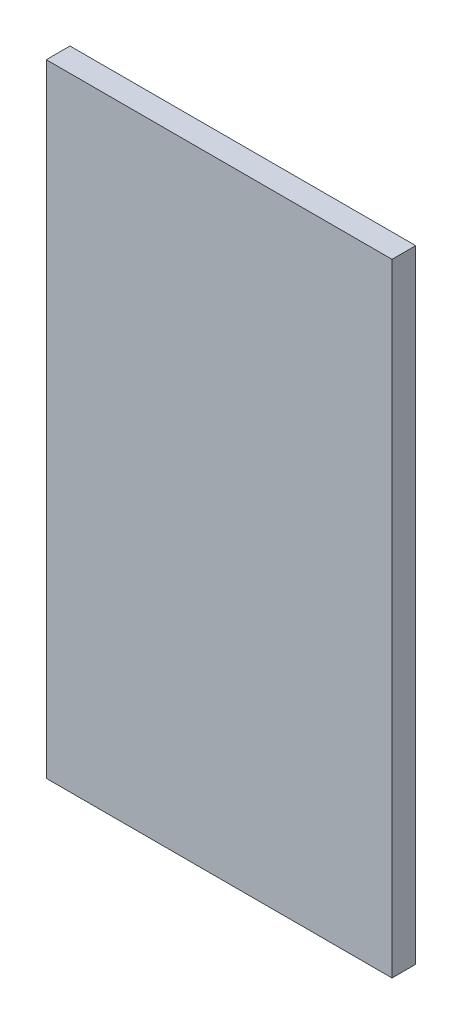
ISO-10303-21;
HEADER;
FILE_DESCRIPTION(('STEP AP214'),'2;1');
FILE_NAME('part.step','',(''),(''),'','','');
FILE_SCHEMA(('AUTOMOTIVE_DESIGN { 1 0 10303 214 1 1 1 1 }'));
ENDSEC;
DATA;
#1=APPLICATION_CONTEXT('core data for automotive mechanical design processes');
#2=APPLICATION_PROTOCOL_DEFINITION('international standard','automotive_design',2000,#1);
#3=PRODUCT_CONTEXT('',#1,'mechanical');
#4=PRODUCT('Part','Part','',(#3));
#5=PRODUCT_RELATED_PRODUCT_CATEGORY('part','',(#4));
#6=PRODUCT_DEFINITION_FORMATION('','',#4);
#7=PRODUCT_DEFINITION_CONTEXT('part definition',#1,'design');
#8=PRODUCT_DEFINITION('design','',#6,#7);
#9=PRODUCT_DEFINITION_SHAPE('','',#8);
#10=(LENGTH_UNIT() NAMED_UNIT(*) SI_UNIT(.MILLI.,.METRE.));
#11=(NAMED_UNIT(*) PLANE_ANGLE_UNIT() SI_UNIT($,.RADIAN.));
#12=(NAMED_UNIT(*) SI_UNIT($,.STERADIAN.) SOLID_ANGLE_UNIT());
#13=UNCERTAINTY_MEASURE_WITH_UNIT(LENGTH_MEASURE(1.E-05),#10,'distance_accuracy_value','');
#14=(GEOMETRIC_REPRESENTATION_CONTEXT(3) GLOBAL_UNCERTAINTY_ASSIGNED_CONTEXT((#13)) GLOBAL_UNIT_ASSIGNED_CONTEXT((#10,
#11,#12)) REPRESENTATION_CONTEXT('',''));
#15=CARTESIAN_POINT('',(0.,0.,0.));
#16=DIRECTION('',(0.,0.,1.));
#17=DIRECTION('',(1.,0.,0.));
#18=AXIS2_PLACEMENT_3D('',#15,#16,#17);
#19=CARTESIAN_POINT('',(4.20008,0.7,0.));
#20=DIRECTION('',(0.,0.,-1.));
#21=DIRECTION('',(-1.,0.,0.));
#22=AXIS2_PLACEMENT_3D('',#19,#20,#21);
#23=PLANE('',#22);
#24=DIRECTION('',(1.,0.,0.));
#25=VECTOR('',#24,1.);
#26=CARTESIAN_POINT('',(3.95008,1.15,0.));
#27=LINE('',#26,#25);
#28=CARTESIAN_POINT('',(3.95008,1.15,0.));
#29=VERTEX_POINT('',#28);
#30=CARTESIAN_POINT('',(4.45008,1.15,0.));
#31=VERTEX_POINT('',#30);
#32=EDGE_CURVE('E55',#29,#31,#27,.T.);
#33=ORIENTED_EDGE('',*,*,#32,.T.);
#34=DIRECTION('',(0.,1.,0.));
#35=VECTOR('',#34,1.);
#36=CARTESIAN_POINT('',(4.45008,1.15,0.));
#37=LINE('',#36,#35);
#38=CARTESIAN_POINT('',(4.45008,0.25,0.));
#39=VERTEX_POINT('',#38);
#40=EDGE_CURVE('E57',#31,#39,#37,.F.);
#41=ORIENTED_EDGE('',*,*,#40,.T.);
#42=DIRECTION('',(1.,0.,0.));
#43=VECTOR('',#42,1.);
#44=CARTESIAN_POINT('',(4.45008,0.25,0.));
#45=LINE('',#44,#43);
#46=CARTESIAN_POINT('',(3.95008,0.25,0.));
#47=VERTEX_POINT('',#46);
#48=EDGE_CURVE('E20',#39,#47,#45,.F.);
#49=ORIENTED_EDGE('',*,*,#48,.T.);
#50=DIRECTION('',(0.,1.,0.));
#51=VECTOR('',#50,1.);
#52=CARTESIAN_POINT('',(3.95008,0.25,0.));
#53=LINE('',#52,#51);
#54=EDGE_CURVE('E80',#47,#29,#53,.T.);
#55=ORIENTED_EDGE('',*,*,#54,.T.);
#56=EDGE_LOOP('',(#33,#41,#49,#55));
#57=FACE_BOUND('',#56,.T.);
#58=ADVANCED_FACE('F17',(#57),#23,.T.);
#59=CARTESIAN_POINT('',(4.45008,0.25,0.));
#60=DIRECTION('',(0.,1.,0.));
#61=DIRECTION('',(0.,0.,1.));
#62=AXIS2_PLACEMENT_3D('',#59,#60,#61);
#63=PLANE('',#62);
#64=DIRECTION('',(0.,0.,-1.));
#65=VECTOR('',#64,1.);
#66=CARTESIAN_POINT('',(3.95008,0.25,0.));
#67=LINE('',#66,#65);
#68=CARTESIAN_POINT('',(3.95008,0.25,0.03429));
#69=VERTEX_POINT('',#68);
#70=EDGE_CURVE('E68',#69,#47,#67,.T.);
#71=ORIENTED_EDGE('',*,*,#70,.T.);
#72=ORIENTED_EDGE('',*,*,#48,.F.);
#73=DIRECTION('',(0.,0.,1.));
#74=VECTOR('',#73,1.);
#75=CARTESIAN_POINT('',(4.45008,0.25,0.));
#76=LINE('',#75,#74);
#77=CARTESIAN_POINT('',(4.45008,0.25,0.03429));
#78=VERTEX_POINT('',#77);
#79=EDGE_CURVE('E63',#39,#78,#76,.T.);
#80=ORIENTED_EDGE('',*,*,#79,.T.);
#81=DIRECTION('',(1.,0.,0.));
#82=VECTOR('',#81,1.);
#83=CARTESIAN_POINT('',(4.20008,0.25,0.03429));
#84=LINE('',#83,#82);
#85=EDGE_CURVE('E83',#69,#78,#84,.T.);
#86=ORIENTED_EDGE('',*,*,#85,.F.);
#87=EDGE_LOOP('',(#71,#72,#80,#86));
#88=FACE_BOUND('',#87,.T.);
#89=ADVANCED_FACE('F65',(#88),#63,.F.);
#90=CARTESIAN_POINT('',(4.45008,1.15,0.));
#91=DIRECTION('',(-1.,0.,0.));
#92=DIRECTION('',(0.,0.,1.));
#93=AXIS2_PLACEMENT_3D('',#90,#91,#92);
#94=PLANE('',#93);
#95=ORIENTED_EDGE('',*,*,#79,.F.);
#96=ORIENTED_EDGE('',*,*,#40,.F.);
#97=DIRECTION('',(0.,0.,-1.));
#98=VECTOR('',#97,1.);
#99=CARTESIAN_POINT('',(4.45008,1.15,0.));
#100=LINE('',#99,#98);
#101=CARTESIAN_POINT('',(4.45008,1.15,0.03429));
#102=VERTEX_POINT('',#101);
#103=EDGE_CURVE('E75',#31,#102,#100,.F.);
#104=ORIENTED_EDGE('',*,*,#103,.T.);
#105=DIRECTION('',(0.,1.,0.));
#106=VECTOR('',#105,1.);
#107=CARTESIAN_POINT('',(4.45008,0.7,0.03429));
#108=LINE('',#107,#106);
#109=EDGE_CURVE('E72',#78,#102,#108,.T.);
#110=ORIENTED_EDGE('',*,*,#109,.F.);
#111=EDGE_LOOP('',(#95,#96,#104,#110));
#112=FACE_BOUND('',#111,.T.);
#113=ADVANCED_FACE('F70',(#112),#94,.F.);
#114=CARTESIAN_POINT('',(3.95008,1.15,0.));
#115=DIRECTION('',(0.,-1.,0.));
#116=DIRECTION('',(0.,0.,-1.));
#117=AXIS2_PLACEMENT_3D('',#114,#115,#116);
#118=PLANE('',#117);
#119=ORIENTED_EDGE('',*,*,#103,.F.);
#120=ORIENTED_EDGE('',*,*,#32,.F.);
#121=DIRECTION('',(0.,0.,-1.));
#122=VECTOR('',#121,1.);
#123=CARTESIAN_POINT('',(3.95008,1.15,0.));
#124=LINE('',#123,#122);
#125=CARTESIAN_POINT('',(3.95008,1.15,0.03429));
#126=VERTEX_POINT('',#125);
#127=EDGE_CURVE('E35',#29,#126,#124,.F.);
#128=ORIENTED_EDGE('',*,*,#127,.T.);
#129=DIRECTION('',(1.,0.,0.));
#130=VECTOR('',#129,1.);
#131=CARTESIAN_POINT('',(4.20008,1.15,0.03429));
#132=LINE('',#131,#130);
#133=EDGE_CURVE('E26',#102,#126,#132,.F.);
#134=ORIENTED_EDGE('',*,*,#133,.F.);
#135=EDGE_LOOP('',(#119,#120,#128,#134));
#136=FACE_BOUND('',#135,.T.);
#137=ADVANCED_FACE('F89',(#136),#118,.F.);
#138=CARTESIAN_POINT('',(3.95008,0.25,0.));
#139=DIRECTION('',(1.,0.,0.));
#140=DIRECTION('',(0.,0.,-1.));
#141=AXIS2_PLACEMENT_3D('',#138,#139,#140);
#142=PLANE('',#141);
#143=ORIENTED_EDGE('',*,*,#127,.F.);
#144=ORIENTED_EDGE('',*,*,#54,.F.);
#145=ORIENTED_EDGE('',*,*,#70,.F.);
#146=DIRECTION('',(0.,1.,0.));
#147=VECTOR('',#146,1.);
#148=CARTESIAN_POINT('',(3.95008,0.7,0.03429));
#149=LINE('',#148,#147);
#150=EDGE_CURVE('E11',#126,#69,#149,.F.);
#151=ORIENTED_EDGE('',*,*,#150,.F.);
#152=EDGE_LOOP('',(#143,#144,#145,#151));
#153=FACE_BOUND('',#152,.T.);
#154=ADVANCED_FACE('F91',(#153),#142,.F.);
#155=CARTESIAN_POINT('',(4.20008,0.7,0.03429));
#156=DIRECTION('',(0.,0.,1.));
#157=DIRECTION('',(1.,0.,0.));
#158=AXIS2_PLACEMENT_3D('',#155,#156,#157);
#159=PLANE('',#158);
#160=ORIENTED_EDGE('',*,*,#133,.T.);
#161=ORIENTED_EDGE('',*,*,#150,.T.);
#162=ORIENTED_EDGE('',*,*,#85,.T.);
#163=ORIENTED_EDGE('',*,*,#109,.T.);
#164=EDGE_LOOP('',(#160,#161,#162,#163));
#165=FACE_BOUND('',#164,.T.);
#166=ADVANCED_FACE('F88',(#165),#159,.T.);
#167=CLOSED_SHELL('',(#58,#89,#113,#137,#154,#166));
#168=MANIFOLD_SOLID_BREP('B1',#167);
#169=ADVANCED_BREP_SHAPE_REPRESENTATION('',(#18,#168),#14);
#170=SHAPE_DEFINITION_REPRESENTATION(#9,#169);
ENDSEC;
END-ISO-10303-21;
